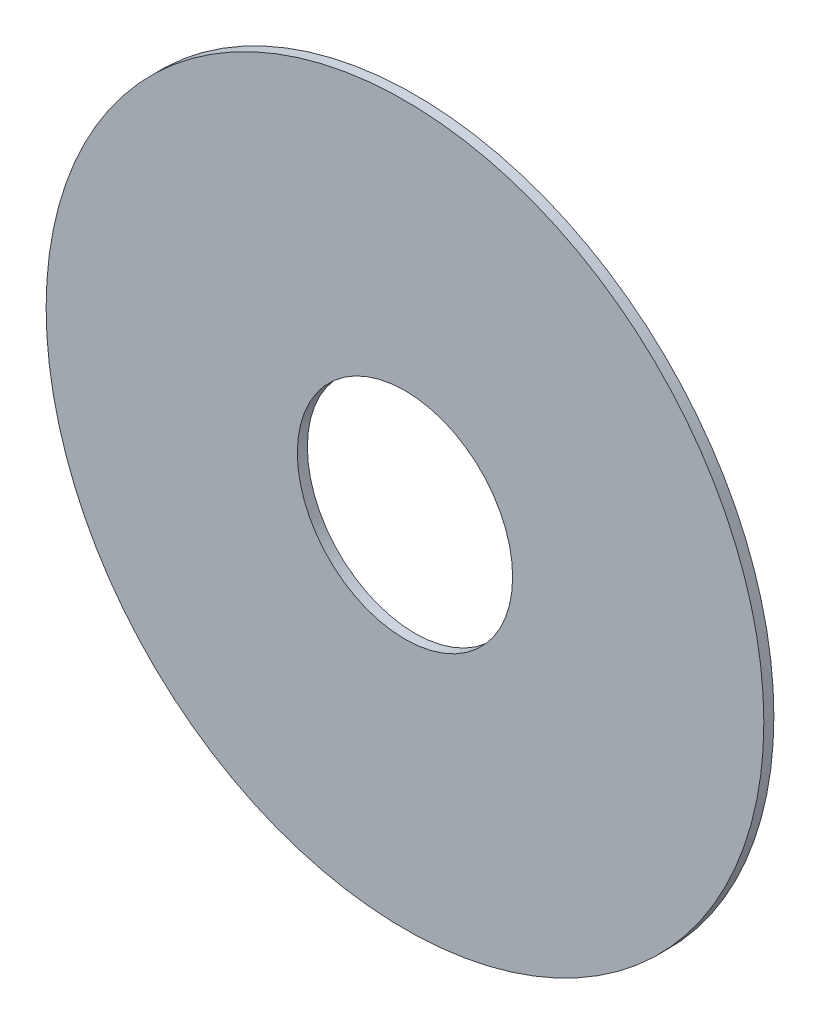
ISO-10303-21;
HEADER;
FILE_DESCRIPTION(('STEP AP214'),'2;1');
FILE_NAME('part.step','',(''),(''),'','','');
FILE_SCHEMA(('AUTOMOTIVE_DESIGN { 1 0 10303 214 1 1 1 1 }'));
ENDSEC;
DATA;
#1=APPLICATION_CONTEXT('core data for automotive mechanical design processes');
#2=APPLICATION_PROTOCOL_DEFINITION('international standard','automotive_design',2000,#1);
#3=PRODUCT_CONTEXT('',#1,'mechanical');
#4=PRODUCT('Part','Part','',(#3));
#5=PRODUCT_RELATED_PRODUCT_CATEGORY('part','',(#4));
#6=PRODUCT_DEFINITION_FORMATION('','',#4);
#7=PRODUCT_DEFINITION_CONTEXT('part definition',#1,'design');
#8=PRODUCT_DEFINITION('design','',#6,#7);
#9=PRODUCT_DEFINITION_SHAPE('','',#8);
#10=(LENGTH_UNIT() NAMED_UNIT(*) SI_UNIT(.MILLI.,.METRE.));
#11=(NAMED_UNIT(*) PLANE_ANGLE_UNIT() SI_UNIT($,.RADIAN.));
#12=(NAMED_UNIT(*) SI_UNIT($,.STERADIAN.) SOLID_ANGLE_UNIT());
#13=UNCERTAINTY_MEASURE_WITH_UNIT(LENGTH_MEASURE(1.E-05),#10,'distance_accuracy_value','');
#14=(GEOMETRIC_REPRESENTATION_CONTEXT(3) GLOBAL_UNCERTAINTY_ASSIGNED_CONTEXT((#13)) GLOBAL_UNIT_ASSIGNED_CONTEXT((#10,
#11,#12)) REPRESENTATION_CONTEXT('',''));
#15=CARTESIAN_POINT('',(0.,0.,0.));
#16=DIRECTION('',(0.,0.,1.));
#17=DIRECTION('',(1.,0.,0.));
#18=AXIS2_PLACEMENT_3D('',#15,#16,#17);
#19=CARTESIAN_POINT('',(170.18,-110.236,-0.045));
#20=DIRECTION('',(0.,0.,-1.));
#21=DIRECTION('',(0.,-1.,0.));
#22=AXIS2_PLACEMENT_3D('',#19,#20,#21);
#23=CYLINDRICAL_SURFACE('',#22,0.375);
#24=CARTESIAN_POINT('',(170.18,-110.236,1.67));
#25=DIRECTION('',(0.,0.,-1.));
#26=DIRECTION('',(0.,-1.,0.));
#27=AXIS2_PLACEMENT_3D('',#24,#25,#26);
#28=CIRCLE('',#27,0.375);
#29=CARTESIAN_POINT('',(170.18,-110.611,1.67));
#30=VERTEX_POINT('',#29);
#31=EDGE_CURVE('E25',#30,#30,#28,.T.);
#32=ORIENTED_EDGE('',*,*,#31,.T.);
#33=DIRECTION('',(0.,0.,1.));
#34=VECTOR('',#33,1.);
#35=CARTESIAN_POINT('',(170.18,-110.611,-0.045));
#36=LINE('',#35,#34);
#37=CARTESIAN_POINT('',(170.18,-110.611,1.705));
#38=VERTEX_POINT('',#37);
#39=EDGE_CURVE('E11',#30,#38,#36,.T.);
#40=ORIENTED_EDGE('',*,*,#39,.T.);
#41=CARTESIAN_POINT('',(170.18,-110.236,1.705));
#42=DIRECTION('',(0.,0.,-1.));
#43=DIRECTION('',(0.,-1.,0.));
#44=AXIS2_PLACEMENT_3D('',#41,#42,#43);
#45=CIRCLE('',#44,0.375);
#46=EDGE_CURVE('E69',#38,#38,#45,.T.);
#47=ORIENTED_EDGE('',*,*,#46,.F.);
#48=ORIENTED_EDGE('',*,*,#39,.F.);
#49=EDGE_LOOP('',(#32,#40,#47,#48));
#50=FACE_BOUND('',#49,.T.);
#51=ADVANCED_FACE('F17',(#50),#23,.F.);
#52=CARTESIAN_POINT('',(170.18,-110.236,1.67));
#53=DIRECTION('',(0.,0.,1.));
#54=DIRECTION('',(1.,0.,0.));
#55=AXIS2_PLACEMENT_3D('',#52,#53,#54);
#56=PLANE('',#55);
#57=ORIENTED_EDGE('',*,*,#31,.F.);
#58=EDGE_LOOP('',(#57));
#59=FACE_BOUND('',#58,.T.);
#60=CARTESIAN_POINT('',(170.18,-110.236,1.67));
#61=DIRECTION('',(0.,0.,1.));
#62=DIRECTION('',(1.,0.,0.));
#63=AXIS2_PLACEMENT_3D('',#60,#61,#62);
#64=CIRCLE('',#63,1.25);
#65=CARTESIAN_POINT('',(171.43,-110.236,1.67));
#66=VERTEX_POINT('',#65);
#67=EDGE_CURVE('E56',#66,#66,#64,.T.);
#68=ORIENTED_EDGE('',*,*,#67,.F.);
#69=EDGE_LOOP('',(#68));
#70=FACE_BOUND('',#69,.T.);
#71=ADVANCED_FACE('F77',(#59,#70),#56,.F.);
#72=CARTESIAN_POINT('',(170.18,-110.236,1.705));
#73=DIRECTION('',(0.,0.,1.));
#74=DIRECTION('',(1.,0.,0.));
#75=AXIS2_PLACEMENT_3D('',#72,#73,#74);
#76=PLANE('',#75);
#77=ORIENTED_EDGE('',*,*,#46,.T.);
#78=EDGE_LOOP('',(#77));
#79=FACE_BOUND('',#78,.T.);
#80=CARTESIAN_POINT('',(170.18,-110.236,1.705));
#81=DIRECTION('',(0.,0.,1.));
#82=DIRECTION('',(1.,0.,0.));
#83=AXIS2_PLACEMENT_3D('',#80,#81,#82);
#84=CIRCLE('',#83,1.25);
#85=CARTESIAN_POINT('',(171.43,-110.236,1.705));
#86=VERTEX_POINT('',#85);
#87=EDGE_CURVE('E54',#86,#86,#84,.T.);
#88=ORIENTED_EDGE('',*,*,#87,.T.);
#89=EDGE_LOOP('',(#88));
#90=FACE_BOUND('',#89,.T.);
#91=ADVANCED_FACE('F60',(#79,#90),#76,.T.);
#92=CARTESIAN_POINT('',(170.18,-110.236,1.67));
#93=DIRECTION('',(0.,0.,1.));
#94=DIRECTION('',(1.,0.,0.));
#95=AXIS2_PLACEMENT_3D('',#92,#93,#94);
#96=CYLINDRICAL_SURFACE('',#95,1.25);
#97=ORIENTED_EDGE('',*,*,#87,.F.);
#98=DIRECTION('',(0.,0.,1.));
#99=VECTOR('',#98,1.);
#100=CARTESIAN_POINT('',(171.43,-110.236,1.67));
#101=LINE('',#100,#99);
#102=EDGE_CURVE('E51',#66,#86,#101,.T.);
#103=ORIENTED_EDGE('',*,*,#102,.F.);
#104=ORIENTED_EDGE('',*,*,#67,.T.);
#105=ORIENTED_EDGE('',*,*,#102,.T.);
#106=EDGE_LOOP('',(#97,#103,#104,#105));
#107=FACE_BOUND('',#106,.T.);
#108=ADVANCED_FACE('F53',(#107),#96,.T.);
#109=CLOSED_SHELL('',(#51,#71,#91,#108));
#110=MANIFOLD_SOLID_BREP('B1',#109);
#111=ADVANCED_BREP_SHAPE_REPRESENTATION('',(#18,#110),#14);
#112=SHAPE_DEFINITION_REPRESENTATION(#9,#111);
ENDSEC;
END-ISO-10303-21;
